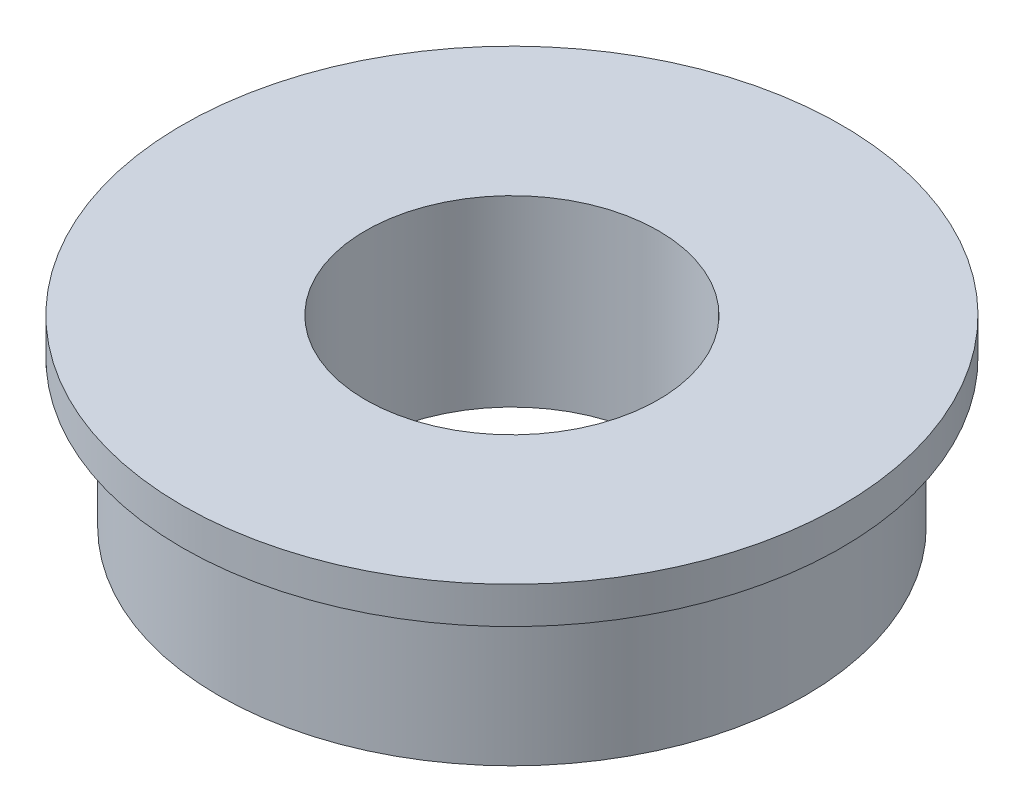
ISO-10303-21;
HEADER;
FILE_DESCRIPTION(('STEP AP214'),'2;1');
FILE_NAME('part.step','',(''),(''),'','','');
FILE_SCHEMA(('AUTOMOTIVE_DESIGN { 1 0 10303 214 1 1 1 1 }'));
ENDSEC;
DATA;
#1=APPLICATION_CONTEXT('core data for automotive mechanical design processes');
#2=APPLICATION_PROTOCOL_DEFINITION('international standard','automotive_design',2000,#1);
#3=PRODUCT_CONTEXT('',#1,'mechanical');
#4=PRODUCT('Part','Part','',(#3));
#5=PRODUCT_RELATED_PRODUCT_CATEGORY('part','',(#4));
#6=PRODUCT_DEFINITION_FORMATION('','',#4);
#7=PRODUCT_DEFINITION_CONTEXT('part definition',#1,'design');
#8=PRODUCT_DEFINITION('design','',#6,#7);
#9=PRODUCT_DEFINITION_SHAPE('','',#8);
#10=(LENGTH_UNIT() NAMED_UNIT(*) SI_UNIT(.MILLI.,.METRE.));
#11=(NAMED_UNIT(*) PLANE_ANGLE_UNIT() SI_UNIT($,.RADIAN.));
#12=(NAMED_UNIT(*) SI_UNIT($,.STERADIAN.) SOLID_ANGLE_UNIT());
#13=UNCERTAINTY_MEASURE_WITH_UNIT(LENGTH_MEASURE(1.E-05),#10,'distance_accuracy_value','');
#14=(GEOMETRIC_REPRESENTATION_CONTEXT(3) GLOBAL_UNCERTAINTY_ASSIGNED_CONTEXT((#13)) GLOBAL_UNIT_ASSIGNED_CONTEXT((#10,
#11,#12)) REPRESENTATION_CONTEXT('',''));
#15=CARTESIAN_POINT('',(0.,0.,0.));
#16=DIRECTION('',(0.,0.,1.));
#17=DIRECTION('',(1.,0.,0.));
#18=AXIS2_PLACEMENT_3D('',#15,#16,#17);
#19=CARTESIAN_POINT('',(0.,2.5,0.));
#20=DIRECTION('',(0.,-1.,0.));
#21=DIRECTION('',(0.,0.,-1.));
#22=AXIS2_PLACEMENT_3D('',#19,#20,#21);
#23=CYLINDRICAL_SURFACE('',#22,8.);
#24=CARTESIAN_POINT('',(0.,-2.5,0.));
#25=DIRECTION('',(0.,1.,0.));
#26=DIRECTION('',(0.,0.,1.));
#27=AXIS2_PLACEMENT_3D('',#24,#25,#26);
#28=CIRCLE('',#27,8.);
#29=CARTESIAN_POINT('',(0.,-2.5,8.));
#30=VERTEX_POINT('',#29);
#31=EDGE_CURVE('E43',#30,#30,#28,.T.);
#32=ORIENTED_EDGE('',*,*,#31,.T.);
#33=EDGE_LOOP('',(#32));
#34=FACE_BOUND('',#33,.T.);
#35=CARTESIAN_POINT('',(0.,1.5,0.));
#36=DIRECTION('',(0.,1.,0.));
#37=DIRECTION('',(0.,0.,1.));
#38=AXIS2_PLACEMENT_3D('',#35,#36,#37);
#39=CIRCLE('',#38,8.);
#40=CARTESIAN_POINT('',(0.,1.5,8.));
#41=VERTEX_POINT('',#40);
#42=EDGE_CURVE('E11',#41,#41,#39,.T.);
#43=ORIENTED_EDGE('',*,*,#42,.F.);
#44=EDGE_LOOP('',(#43));
#45=FACE_BOUND('',#44,.T.);
#46=ADVANCED_FACE('F40',(#34,#45),#23,.T.);
#47=CARTESIAN_POINT('',(0.,2.5,0.));
#48=DIRECTION('',(0.,-1.,0.));
#49=DIRECTION('',(0.,0.,-1.));
#50=AXIS2_PLACEMENT_3D('',#47,#48,#49);
#51=CYLINDRICAL_SURFACE('',#50,4.);
#52=CARTESIAN_POINT('',(0.,-2.5,0.));
#53=DIRECTION('',(0.,1.,0.));
#54=DIRECTION('',(0.,0.,1.));
#55=AXIS2_PLACEMENT_3D('',#52,#53,#54);
#56=CIRCLE('',#55,4.);
#57=CARTESIAN_POINT('',(0.,-2.5,4.));
#58=VERTEX_POINT('',#57);
#59=EDGE_CURVE('E51',#58,#58,#56,.T.);
#60=ORIENTED_EDGE('',*,*,#59,.F.);
#61=EDGE_LOOP('',(#60));
#62=FACE_BOUND('',#61,.T.);
#63=CARTESIAN_POINT('',(0.,2.5,0.));
#64=DIRECTION('',(0.,-1.,0.));
#65=DIRECTION('',(0.,0.,-1.));
#66=AXIS2_PLACEMENT_3D('',#63,#64,#65);
#67=CIRCLE('',#66,4.);
#68=CARTESIAN_POINT('',(0.,2.5,-4.));
#69=VERTEX_POINT('',#68);
#70=EDGE_CURVE('E63',#69,#69,#67,.T.);
#71=ORIENTED_EDGE('',*,*,#70,.F.);
#72=EDGE_LOOP('',(#71));
#73=FACE_BOUND('',#72,.T.);
#74=ADVANCED_FACE('F71',(#62,#73),#51,.F.);
#75=CARTESIAN_POINT('',(0.,-2.5,0.));
#76=DIRECTION('',(0.,1.,0.));
#77=DIRECTION('',(0.,0.,1.));
#78=AXIS2_PLACEMENT_3D('',#75,#76,#77);
#79=PLANE('',#78);
#80=ORIENTED_EDGE('',*,*,#31,.F.);
#81=EDGE_LOOP('',(#80));
#82=FACE_BOUND('',#81,.T.);
#83=ORIENTED_EDGE('',*,*,#59,.T.);
#84=EDGE_LOOP('',(#83));
#85=FACE_BOUND('',#84,.T.);
#86=ADVANCED_FACE('F73',(#82,#85),#79,.F.);
#87=CARTESIAN_POINT('',(0.,1.5,0.));
#88=DIRECTION('',(0.,1.,0.));
#89=DIRECTION('',(0.,0.,1.));
#90=AXIS2_PLACEMENT_3D('',#87,#88,#89);
#91=CYLINDRICAL_SURFACE('',#90,9.);
#92=CARTESIAN_POINT('',(0.,1.5,0.));
#93=DIRECTION('',(0.,1.,0.));
#94=DIRECTION('',(0.,0.,1.));
#95=AXIS2_PLACEMENT_3D('',#92,#93,#94);
#96=CIRCLE('',#95,9.);
#97=CARTESIAN_POINT('',(0.,1.5,9.));
#98=VERTEX_POINT('',#97);
#99=EDGE_CURVE('E56',#98,#98,#96,.T.);
#100=ORIENTED_EDGE('',*,*,#99,.T.);
#101=EDGE_LOOP('',(#100));
#102=FACE_BOUND('',#101,.T.);
#103=CARTESIAN_POINT('',(0.,2.5,0.));
#104=DIRECTION('',(0.,1.,0.));
#105=DIRECTION('',(0.,0.,1.));
#106=AXIS2_PLACEMENT_3D('',#103,#104,#105);
#107=CIRCLE('',#106,9.);
#108=CARTESIAN_POINT('',(0.,2.5,9.));
#109=VERTEX_POINT('',#108);
#110=EDGE_CURVE('E53',#109,#109,#107,.T.);
#111=ORIENTED_EDGE('',*,*,#110,.F.);
#112=EDGE_LOOP('',(#111));
#113=FACE_BOUND('',#112,.T.);
#114=ADVANCED_FACE('F81',(#102,#113),#91,.T.);
#115=CARTESIAN_POINT('',(0.,1.5,0.));
#116=DIRECTION('',(0.,1.,0.));
#117=DIRECTION('',(0.,0.,1.));
#118=AXIS2_PLACEMENT_3D('',#115,#116,#117);
#119=PLANE('',#118);
#120=ORIENTED_EDGE('',*,*,#42,.T.);
#121=EDGE_LOOP('',(#120));
#122=FACE_BOUND('',#121,.T.);
#123=ORIENTED_EDGE('',*,*,#99,.F.);
#124=EDGE_LOOP('',(#123));
#125=FACE_BOUND('',#124,.T.);
#126=ADVANCED_FACE('F88',(#122,#125),#119,.F.);
#127=CARTESIAN_POINT('',(0.,2.5,0.));
#128=DIRECTION('',(0.,1.,0.));
#129=DIRECTION('',(0.,0.,1.));
#130=AXIS2_PLACEMENT_3D('',#127,#128,#129);
#131=PLANE('',#130);
#132=ORIENTED_EDGE('',*,*,#70,.T.);
#133=EDGE_LOOP('',(#132));
#134=FACE_BOUND('',#133,.T.);
#135=ORIENTED_EDGE('',*,*,#110,.T.);
#136=EDGE_LOOP('',(#135));
#137=FACE_BOUND('',#136,.T.);
#138=ADVANCED_FACE('F68',(#134,#137),#131,.T.);
#139=CLOSED_SHELL('',(#46,#74,#86,#114,#126,#138));
#140=MANIFOLD_SOLID_BREP('B2',#139);
#141=ADVANCED_BREP_SHAPE_REPRESENTATION('',(#18,#140),#14);
#142=SHAPE_DEFINITION_REPRESENTATION(#9,#141);
ENDSEC;
END-ISO-10303-21;
